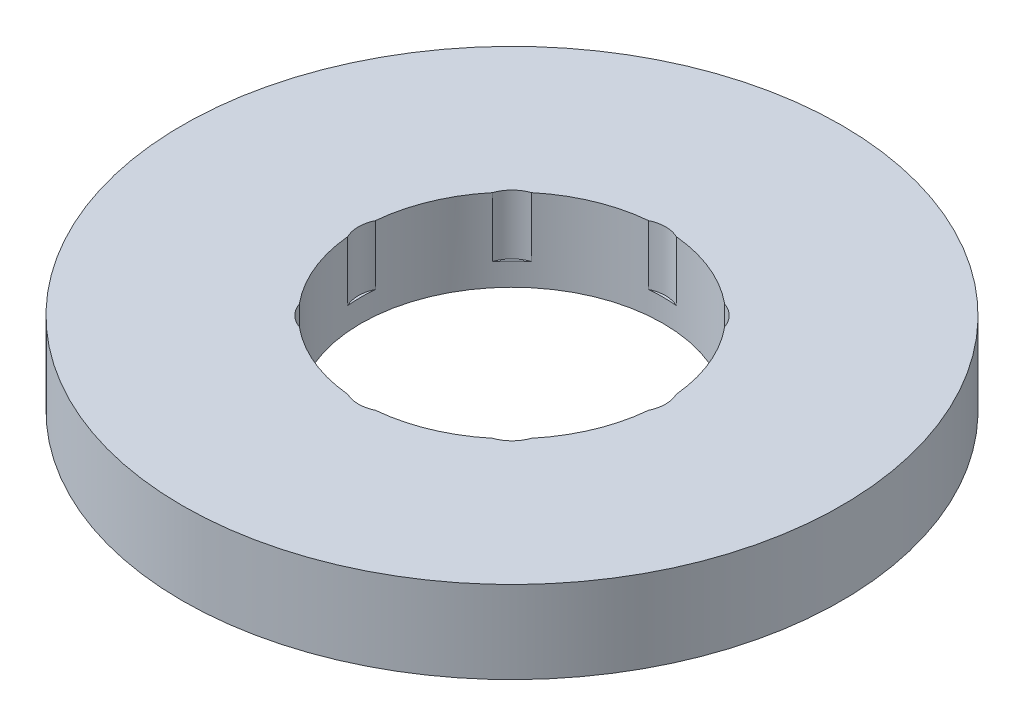
ISO-10303-21;
HEADER;
FILE_DESCRIPTION(('STEP AP214'),'2;1');
FILE_NAME('part.step','',(''),(''),'','','');
FILE_SCHEMA(('AUTOMOTIVE_DESIGN { 1 0 10303 214 1 1 1 1 }'));
ENDSEC;
DATA;
#1=APPLICATION_CONTEXT('core data for automotive mechanical design processes');
#2=APPLICATION_PROTOCOL_DEFINITION('international standard','automotive_design',2000,#1);
#3=PRODUCT_CONTEXT('',#1,'mechanical');
#4=PRODUCT('Part','Part','',(#3));
#5=PRODUCT_RELATED_PRODUCT_CATEGORY('part','',(#4));
#6=PRODUCT_DEFINITION_FORMATION('','',#4);
#7=PRODUCT_DEFINITION_CONTEXT('part definition',#1,'design');
#8=PRODUCT_DEFINITION('design','',#6,#7);
#9=PRODUCT_DEFINITION_SHAPE('','',#8);
#10=(LENGTH_UNIT() NAMED_UNIT(*) SI_UNIT(.MILLI.,.METRE.));
#11=(NAMED_UNIT(*) PLANE_ANGLE_UNIT() SI_UNIT($,.RADIAN.));
#12=(NAMED_UNIT(*) SI_UNIT($,.STERADIAN.) SOLID_ANGLE_UNIT());
#13=UNCERTAINTY_MEASURE_WITH_UNIT(LENGTH_MEASURE(1.E-05),#10,'distance_accuracy_value','');
#14=(GEOMETRIC_REPRESENTATION_CONTEXT(3) GLOBAL_UNCERTAINTY_ASSIGNED_CONTEXT((#13)) GLOBAL_UNIT_ASSIGNED_CONTEXT((#10,
#11,#12)) REPRESENTATION_CONTEXT('',''));
#15=CARTESIAN_POINT('',(0.,0.,0.));
#16=DIRECTION('',(0.,0.,1.));
#17=DIRECTION('',(1.,0.,0.));
#18=AXIS2_PLACEMENT_3D('',#15,#16,#17);
#19=CARTESIAN_POINT('',(0.,15.,0.));
#20=DIRECTION('',(0.,-1.,0.));
#21=DIRECTION('',(0.,0.,-1.));
#22=AXIS2_PLACEMENT_3D('',#19,#20,#21);
#23=CYLINDRICAL_SURFACE('',#22,60.);
#24=CARTESIAN_POINT('',(0.,15.,0.));
#25=DIRECTION('',(0.,1.,0.));
#26=DIRECTION('',(0.,0.,1.));
#27=AXIS2_PLACEMENT_3D('',#24,#25,#26);
#28=CIRCLE('',#27,60.);
#29=CARTESIAN_POINT('',(0.,15.,60.));
#30=VERTEX_POINT('',#29);
#31=EDGE_CURVE('E183',#30,#30,#28,.T.);
#32=ORIENTED_EDGE('',*,*,#31,.F.);
#33=EDGE_LOOP('',(#32));
#34=FACE_BOUND('',#33,.T.);
#35=CARTESIAN_POINT('',(0.,0.,0.));
#36=DIRECTION('',(0.,1.,0.));
#37=DIRECTION('',(0.,0.,1.));
#38=AXIS2_PLACEMENT_3D('',#35,#36,#37);
#39=CIRCLE('',#38,60.);
#40=CARTESIAN_POINT('',(0.,0.,60.));
#41=VERTEX_POINT('',#40);
#42=EDGE_CURVE('E182',#41,#41,#39,.T.);
#43=ORIENTED_EDGE('',*,*,#42,.T.);
#44=EDGE_LOOP('',(#43));
#45=FACE_BOUND('',#44,.T.);
#46=ADVANCED_FACE('F39',(#34,#45),#23,.T.);
#47=CARTESIAN_POINT('',(0.,15.,0.));
#48=DIRECTION('',(0.,1.,0.));
#49=DIRECTION('',(0.,0.,1.));
#50=AXIS2_PLACEMENT_3D('',#47,#48,#49);
#51=PLANE('',#50);
#52=CARTESIAN_POINT('',(0.,15.,22.1873358285686));
#53=DIRECTION('',(0.,1.,0.));
#54=DIRECTION('',(1.,0.,0.));
#55=AXIS2_PLACEMENT_3D('',#52,#53,#54);
#56=CIRCLE('',#55,5.77723652002444);
#57=CARTESIAN_POINT('',(-2.52432575617831,15.,27.3838963530885));
#58=VERTEX_POINT('',#57);
#59=CARTESIAN_POINT('',(2.5243257561785,15.,27.3838963530885));
#60=VERTEX_POINT('',#59);
#61=EDGE_CURVE('E256',#58,#60,#56,.T.);
#62=ORIENTED_EDGE('',*,*,#61,.F.);
#63=CARTESIAN_POINT('',(0.,15.,0.));
#64=DIRECTION('',(0.,1.,0.));
#65=DIRECTION('',(0.,0.,1.));
#66=AXIS2_PLACEMENT_3D('',#63,#64,#65);
#67=CIRCLE('',#66,27.5);
#68=CARTESIAN_POINT('',(-17.5783709464608,15.,21.1483066666961));
#69=VERTEX_POINT('',#68);
#70=EDGE_CURVE('E175',#69,#58,#67,.T.);
#71=ORIENTED_EDGE('',*,*,#70,.F.);
#72=CARTESIAN_POINT('',(-15.6888156208441,15.,15.6888156208441));
#73=DIRECTION('',(0.,1.,0.));
#74=DIRECTION('',(0.707106781186549,0.,0.707106781186546));
#75=AXIS2_PLACEMENT_3D('',#72,#73,#74);
#76=CIRCLE('',#75,5.77723652002444);
#77=CARTESIAN_POINT('',(-21.148306666696,15.,17.5783709464609));
#78=VERTEX_POINT('',#77);
#79=EDGE_CURVE('E152',#78,#69,#76,.T.);
#80=ORIENTED_EDGE('',*,*,#79,.F.);
#81=CARTESIAN_POINT('',(-27.3838963530885,15.,2.5243257561784));
#82=VERTEX_POINT('',#81);
#83=EDGE_CURVE('E168',#82,#78,#67,.T.);
#84=ORIENTED_EDGE('',*,*,#83,.F.);
#85=CARTESIAN_POINT('',(-22.1873358285686,15.,0.));
#86=DIRECTION('',(0.,1.,0.));
#87=DIRECTION('',(0.,0.,1.));
#88=AXIS2_PLACEMENT_3D('',#85,#86,#87);
#89=CIRCLE('',#88,5.77723652002444);
#90=CARTESIAN_POINT('',(-27.3838963530885,15.,-2.5243257561784));
#91=VERTEX_POINT('',#90);
#92=EDGE_CURVE('E205',#91,#82,#89,.T.);
#93=ORIENTED_EDGE('',*,*,#92,.F.);
#94=CARTESIAN_POINT('',(-21.1483066666963,15.,-17.5783709464606));
#95=VERTEX_POINT('',#94);
#96=EDGE_CURVE('E181',#95,#91,#67,.T.);
#97=ORIENTED_EDGE('',*,*,#96,.F.);
#98=CARTESIAN_POINT('',(-15.6888156208443,15.,-15.6888156208439));
#99=DIRECTION('',(0.,1.,0.));
#100=DIRECTION('',(-0.707106781186539,0.,0.707106781186556));
#101=AXIS2_PLACEMENT_3D('',#98,#99,#100);
#102=CIRCLE('',#101,5.77723652002444);
#103=CARTESIAN_POINT('',(-17.5783709464611,15.,-21.1483066666958));
#104=VERTEX_POINT('',#103);
#105=EDGE_CURVE('E453',#104,#95,#102,.T.);
#106=ORIENTED_EDGE('',*,*,#105,.F.);
#107=CARTESIAN_POINT('',(-2.52432575617869,15.,-27.3838963530885));
#108=VERTEX_POINT('',#107);
#109=EDGE_CURVE('E189',#108,#104,#67,.T.);
#110=ORIENTED_EDGE('',*,*,#109,.F.);
#111=CARTESIAN_POINT('',(-2.32400007012279E-13,15.,-22.1873358285686));
#112=DIRECTION('',(0.,1.,0.));
#113=DIRECTION('',(-1.,0.,0.));
#114=AXIS2_PLACEMENT_3D('',#111,#112,#113);
#115=CIRCLE('',#114,5.77723652002444);
#116=CARTESIAN_POINT('',(2.52432575617812,15.,-27.3838963530885));
#117=VERTEX_POINT('',#116);
#118=EDGE_CURVE('E462',#117,#108,#115,.T.);
#119=ORIENTED_EDGE('',*,*,#118,.F.);
#120=CARTESIAN_POINT('',(17.5783709464607,15.,-21.1483066666962));
#121=VERTEX_POINT('',#120);
#122=EDGE_CURVE('E197',#121,#117,#67,.T.);
#123=ORIENTED_EDGE('',*,*,#122,.F.);
#124=CARTESIAN_POINT('',(15.688815620844,15.,-15.6888156208443));
#125=DIRECTION('',(0.,1.,0.));
#126=DIRECTION('',(-0.707106781186554,0.,-0.707106781186541));
#127=AXIS2_PLACEMENT_3D('',#124,#125,#126);
#128=CIRCLE('',#127,5.77723652002444);
#129=CARTESIAN_POINT('',(21.1483066666959,15.,-17.578370946461));
#130=VERTEX_POINT('',#129);
#131=EDGE_CURVE('E470',#130,#121,#128,.T.);
#132=ORIENTED_EDGE('',*,*,#131,.F.);
#133=CARTESIAN_POINT('',(27.3838963530885,15.,-2.5243257561784));
#134=VERTEX_POINT('',#133);
#135=EDGE_CURVE('E489',#134,#130,#67,.T.);
#136=ORIENTED_EDGE('',*,*,#135,.F.);
#137=CARTESIAN_POINT('',(22.1873358285686,15.,0.));
#138=DIRECTION('',(0.,1.,0.));
#139=DIRECTION('',(0.,0.,-1.));
#140=AXIS2_PLACEMENT_3D('',#137,#138,#139);
#141=CIRCLE('',#140,5.77723652002444);
#142=CARTESIAN_POINT('',(27.3838963530885,15.,2.5243257561784));
#143=VERTEX_POINT('',#142);
#144=EDGE_CURVE('E476',#143,#134,#141,.T.);
#145=ORIENTED_EDGE('',*,*,#144,.F.);
#146=CARTESIAN_POINT('',(21.1483066666962,15.,17.5783709464607));
#147=VERTEX_POINT('',#146);
#148=EDGE_CURVE('E491',#147,#143,#67,.T.);
#149=ORIENTED_EDGE('',*,*,#148,.F.);
#150=CARTESIAN_POINT('',(15.6888156208442,15.,15.688815620844));
#151=DIRECTION('',(0.,1.,0.));
#152=DIRECTION('',(0.707106781186544,0.,-0.707106781186551));
#153=AXIS2_PLACEMENT_3D('',#150,#151,#152);
#154=CIRCLE('',#153,5.77723652002444);
#155=CARTESIAN_POINT('',(17.578370946461,15.,21.148306666696));
#156=VERTEX_POINT('',#155);
#157=EDGE_CURVE('E475',#156,#147,#154,.T.);
#158=ORIENTED_EDGE('',*,*,#157,.F.);
#159=EDGE_CURVE('E190',#60,#156,#67,.T.);
#160=ORIENTED_EDGE('',*,*,#159,.F.);
#161=EDGE_LOOP('',(#62,#71,#80,#84,#93,#97,#106,#110,#119,#123,#132,#136,#145,#149,#158,#160));
#162=FACE_BOUND('',#161,.T.);
#163=ORIENTED_EDGE('',*,*,#31,.T.);
#164=EDGE_LOOP('',(#163));
#165=FACE_BOUND('',#164,.T.);
#166=ADVANCED_FACE('F170',(#162,#165),#51,.T.);
#167=CARTESIAN_POINT('',(0.,0.,0.));
#168=DIRECTION('',(0.,1.,0.));
#169=DIRECTION('',(0.,0.,1.));
#170=AXIS2_PLACEMENT_3D('',#167,#168,#169);
#171=PLANE('',#170);
#172=CARTESIAN_POINT('',(0.,0.,0.));
#173=DIRECTION('',(0.,1.,0.));
#174=DIRECTION('',(0.,0.,1.));
#175=AXIS2_PLACEMENT_3D('',#172,#173,#174);
#176=CIRCLE('',#175,27.5);
#177=CARTESIAN_POINT('',(0.,0.,27.5));
#178=VERTEX_POINT('',#177);
#179=EDGE_CURVE('E191',#178,#178,#176,.T.);
#180=ORIENTED_EDGE('',*,*,#179,.T.);
#181=EDGE_LOOP('',(#180));
#182=FACE_BOUND('',#181,.T.);
#183=ORIENTED_EDGE('',*,*,#42,.F.);
#184=EDGE_LOOP('',(#183));
#185=FACE_BOUND('',#184,.T.);
#186=ADVANCED_FACE('F277',(#182,#185),#171,.F.);
#187=CARTESIAN_POINT('',(0.,15.,0.));
#188=DIRECTION('',(0.,-1.,0.));
#189=DIRECTION('',(0.,0.,-1.));
#190=AXIS2_PLACEMENT_3D('',#187,#188,#189);
#191=CYLINDRICAL_SURFACE('',#190,27.5);
#192=DIRECTION('',(0.,1.,0.));
#193=VECTOR('',#192,1.);
#194=CARTESIAN_POINT('',(-2.52432575617828,9.56838124463281,27.3838963530885));
#195=LINE('',#194,#193);
#196=CARTESIAN_POINT('',(-2.52432575617831,4.13676248926562,27.3838963530885));
#197=VERTEX_POINT('',#196);
#198=EDGE_CURVE('E11',#197,#58,#195,.T.);
#199=ORIENTED_EDGE('',*,*,#198,.F.);
#200=CARTESIAN_POINT('',(0.,4.13676248926562,0.));
#201=DIRECTION('',(0.,1.,0.));
#202=DIRECTION('',(0.,0.,1.));
#203=AXIS2_PLACEMENT_3D('',#200,#201,#202);
#204=CIRCLE('',#203,27.5);
#205=CARTESIAN_POINT('',(2.5243257561785,4.13676248926562,27.3838963530885));
#206=VERTEX_POINT('',#205);
#207=EDGE_CURVE('E251',#197,#206,#204,.T.);
#208=ORIENTED_EDGE('',*,*,#207,.T.);
#209=DIRECTION('',(0.,1.,0.));
#210=VECTOR('',#209,1.);
#211=CARTESIAN_POINT('',(2.52432575617847,9.56838124463281,27.3838963530885));
#212=LINE('',#211,#210);
#213=EDGE_CURVE('E46',#60,#206,#212,.F.);
#214=ORIENTED_EDGE('',*,*,#213,.F.);
#215=ORIENTED_EDGE('',*,*,#159,.T.);
#216=DIRECTION('',(0.,1.,0.));
#217=VECTOR('',#216,1.);
#218=CARTESIAN_POINT('',(17.578370946461,9.56838124463281,21.148306666696));
#219=LINE('',#218,#217);
#220=CARTESIAN_POINT('',(17.578370946461,4.13676248926562,21.148306666696));
#221=VERTEX_POINT('',#220);
#222=EDGE_CURVE('E253',#221,#156,#219,.T.);
#223=ORIENTED_EDGE('',*,*,#222,.F.);
#224=CARTESIAN_POINT('',(0.,4.13676248926562,0.));
#225=DIRECTION('',(0.,1.,0.));
#226=DIRECTION('',(0.,0.,1.));
#227=AXIS2_PLACEMENT_3D('',#224,#225,#226);
#228=CIRCLE('',#227,27.5);
#229=CARTESIAN_POINT('',(21.1483066666962,4.13676248926562,17.5783709464607));
#230=VERTEX_POINT('',#229);
#231=EDGE_CURVE('E246',#221,#230,#228,.T.);
#232=ORIENTED_EDGE('',*,*,#231,.T.);
#233=DIRECTION('',(0.,1.,0.));
#234=VECTOR('',#233,1.);
#235=CARTESIAN_POINT('',(21.1483066666961,9.56838124463281,17.5783709464608));
#236=LINE('',#235,#234);
#237=EDGE_CURVE('E248',#147,#230,#236,.F.);
#238=ORIENTED_EDGE('',*,*,#237,.F.);
#239=ORIENTED_EDGE('',*,*,#148,.T.);
#240=DIRECTION('',(0.,1.,0.));
#241=VECTOR('',#240,1.);
#242=CARTESIAN_POINT('',(27.3838963530885,9.56838124463281,2.52432575617837));
#243=LINE('',#242,#241);
#244=CARTESIAN_POINT('',(27.3838963530885,4.13676248926562,2.5243257561784));
#245=VERTEX_POINT('',#244);
#246=EDGE_CURVE('E243',#245,#143,#243,.T.);
#247=ORIENTED_EDGE('',*,*,#246,.F.);
#248=CARTESIAN_POINT('',(0.,4.13676248926562,0.));
#249=DIRECTION('',(0.,1.,0.));
#250=DIRECTION('',(0.,0.,1.));
#251=AXIS2_PLACEMENT_3D('',#248,#249,#250);
#252=CIRCLE('',#251,27.5);
#253=CARTESIAN_POINT('',(27.3838963530885,4.13676248926562,-2.5243257561784));
#254=VERTEX_POINT('',#253);
#255=EDGE_CURVE('E236',#245,#254,#252,.T.);
#256=ORIENTED_EDGE('',*,*,#255,.T.);
#257=DIRECTION('',(0.,1.,0.));
#258=VECTOR('',#257,1.);
#259=CARTESIAN_POINT('',(27.3838963530885,9.56838124463281,-2.52432575617837));
#260=LINE('',#259,#258);
#261=EDGE_CURVE('E241',#134,#254,#260,.F.);
#262=ORIENTED_EDGE('',*,*,#261,.F.);
#263=ORIENTED_EDGE('',*,*,#135,.T.);
#264=DIRECTION('',(0.,1.,0.));
#265=VECTOR('',#264,1.);
#266=CARTESIAN_POINT('',(21.1483066666959,9.56838124463281,-17.5783709464611));
#267=LINE('',#266,#265);
#268=CARTESIAN_POINT('',(21.1483066666959,4.13676248926562,-17.578370946461));
#269=VERTEX_POINT('',#268);
#270=EDGE_CURVE('E237',#269,#130,#267,.T.);
#271=ORIENTED_EDGE('',*,*,#270,.F.);
#272=CARTESIAN_POINT('',(0.,4.13676248926562,0.));
#273=DIRECTION('',(0.,1.,0.));
#274=DIRECTION('',(0.,0.,1.));
#275=AXIS2_PLACEMENT_3D('',#272,#273,#274);
#276=CIRCLE('',#275,27.5);
#277=CARTESIAN_POINT('',(17.5783709464607,4.13676248926562,-21.1483066666962));
#278=VERTEX_POINT('',#277);
#279=EDGE_CURVE('E229',#269,#278,#276,.T.);
#280=ORIENTED_EDGE('',*,*,#279,.T.);
#281=DIRECTION('',(0.,1.,0.));
#282=VECTOR('',#281,1.);
#283=CARTESIAN_POINT('',(17.5783709464607,9.56838124463281,-21.1483066666962));
#284=LINE('',#283,#282);
#285=EDGE_CURVE('E232',#121,#278,#284,.F.);
#286=ORIENTED_EDGE('',*,*,#285,.F.);
#287=ORIENTED_EDGE('',*,*,#122,.T.);
#288=DIRECTION('',(0.,1.,0.));
#289=VECTOR('',#288,1.);
#290=CARTESIAN_POINT('',(2.52432575617809,9.56838124463281,-27.3838963530886));
#291=LINE('',#290,#289);
#292=CARTESIAN_POINT('',(2.52432575617812,4.13676248926562,-27.3838963530885));
#293=VERTEX_POINT('',#292);
#294=EDGE_CURVE('E227',#293,#117,#291,.T.);
#295=ORIENTED_EDGE('',*,*,#294,.F.);
#296=CARTESIAN_POINT('',(0.,4.13676248926562,0.));
#297=DIRECTION('',(0.,1.,0.));
#298=DIRECTION('',(0.,0.,1.));
#299=AXIS2_PLACEMENT_3D('',#296,#297,#298);
#300=CIRCLE('',#299,27.5);
#301=CARTESIAN_POINT('',(-2.52432575617869,4.13676248926562,-27.3838963530885));
#302=VERTEX_POINT('',#301);
#303=EDGE_CURVE('E225',#293,#302,#300,.T.);
#304=ORIENTED_EDGE('',*,*,#303,.T.);
#305=DIRECTION('',(0.,1.,0.));
#306=VECTOR('',#305,1.);
#307=CARTESIAN_POINT('',(-2.52432575617866,9.56838124463281,-27.3838963530885));
#308=LINE('',#307,#306);
#309=EDGE_CURVE('E223',#108,#302,#308,.F.);
#310=ORIENTED_EDGE('',*,*,#309,.F.);
#311=ORIENTED_EDGE('',*,*,#109,.T.);
#312=DIRECTION('',(0.,1.,0.));
#313=VECTOR('',#312,1.);
#314=CARTESIAN_POINT('',(-17.5783709464611,9.56838124463281,-21.1483066666958));
#315=LINE('',#314,#313);
#316=CARTESIAN_POINT('',(-17.5783709464611,4.13676248926562,-21.1483066666958));
#317=VERTEX_POINT('',#316);
#318=EDGE_CURVE('E219',#317,#104,#315,.T.);
#319=ORIENTED_EDGE('',*,*,#318,.F.);
#320=CARTESIAN_POINT('',(0.,4.13676248926562,0.));
#321=DIRECTION('',(0.,1.,0.));
#322=DIRECTION('',(0.,0.,1.));
#323=AXIS2_PLACEMENT_3D('',#320,#321,#322);
#324=CIRCLE('',#323,27.5);
#325=CARTESIAN_POINT('',(-21.1483066666963,4.13676248926562,-17.5783709464606));
#326=VERTEX_POINT('',#325);
#327=EDGE_CURVE('E159',#317,#326,#324,.T.);
#328=ORIENTED_EDGE('',*,*,#327,.T.);
#329=DIRECTION('',(0.,1.,0.));
#330=VECTOR('',#329,1.);
#331=CARTESIAN_POINT('',(-21.1483066666963,9.56838124463281,-17.5783709464606));
#332=LINE('',#331,#330);
#333=EDGE_CURVE('E220',#95,#326,#332,.F.);
#334=ORIENTED_EDGE('',*,*,#333,.F.);
#335=ORIENTED_EDGE('',*,*,#96,.T.);
#336=DIRECTION('',(0.,1.,0.));
#337=VECTOR('',#336,1.);
#338=CARTESIAN_POINT('',(-27.3838963530885,9.56838124463281,-2.52432575617837));
#339=LINE('',#338,#337);
#340=CARTESIAN_POINT('',(-27.3838963530885,4.13676248926562,-2.5243257561784));
#341=VERTEX_POINT('',#340);
#342=EDGE_CURVE('E209',#341,#91,#339,.T.);
#343=ORIENTED_EDGE('',*,*,#342,.F.);
#344=CARTESIAN_POINT('',(0.,4.13676248926562,0.));
#345=DIRECTION('',(0.,1.,0.));
#346=DIRECTION('',(0.,0.,1.));
#347=AXIS2_PLACEMENT_3D('',#344,#345,#346);
#348=CIRCLE('',#347,27.5);
#349=CARTESIAN_POINT('',(-27.3838963530885,4.13676248926562,2.5243257561784));
#350=VERTEX_POINT('',#349);
#351=EDGE_CURVE('E206',#341,#350,#348,.T.);
#352=ORIENTED_EDGE('',*,*,#351,.T.);
#353=DIRECTION('',(0.,1.,0.));
#354=VECTOR('',#353,1.);
#355=CARTESIAN_POINT('',(-27.3838963530885,9.56838124463281,2.52432575617837));
#356=LINE('',#355,#354);
#357=EDGE_CURVE('E179',#82,#350,#356,.F.);
#358=ORIENTED_EDGE('',*,*,#357,.F.);
#359=ORIENTED_EDGE('',*,*,#83,.T.);
#360=DIRECTION('',(0.,1.,0.));
#361=VECTOR('',#360,1.);
#362=CARTESIAN_POINT('',(-21.148306666696,9.56838124463281,17.5783709464609));
#363=LINE('',#362,#361);
#364=CARTESIAN_POINT('',(-21.148306666696,4.13676248926562,17.5783709464609));
#365=VERTEX_POINT('',#364);
#366=EDGE_CURVE('E147',#365,#78,#363,.T.);
#367=ORIENTED_EDGE('',*,*,#366,.F.);
#368=CARTESIAN_POINT('',(0.,4.13676248926562,0.));
#369=DIRECTION('',(0.,1.,0.));
#370=DIRECTION('',(0.,0.,1.));
#371=AXIS2_PLACEMENT_3D('',#368,#369,#370);
#372=CIRCLE('',#371,27.5);
#373=CARTESIAN_POINT('',(-17.5783709464608,4.13676248926562,21.1483066666961));
#374=VERTEX_POINT('',#373);
#375=EDGE_CURVE('E215',#365,#374,#372,.T.);
#376=ORIENTED_EDGE('',*,*,#375,.T.);
#377=DIRECTION('',(0.,1.,0.));
#378=VECTOR('',#377,1.);
#379=CARTESIAN_POINT('',(-17.5783709464608,9.56838124463281,21.1483066666961));
#380=LINE('',#379,#378);
#381=EDGE_CURVE('E161',#69,#374,#380,.F.);
#382=ORIENTED_EDGE('',*,*,#381,.F.);
#383=ORIENTED_EDGE('',*,*,#70,.T.);
#384=EDGE_LOOP('',(#199,#208,#214,#215,#223,#232,#238,#239,#247,#256,#262,#263,#271,#280,#286,
#287,#295,#304,#310,#311,#319,#328,#334,#335,#343,#352,#358,#359,#367,#376,#382,#383));
#385=FACE_BOUND('',#384,.T.);
#386=ORIENTED_EDGE('',*,*,#179,.F.);
#387=EDGE_LOOP('',(#386));
#388=FACE_BOUND('',#387,.T.);
#389=ADVANCED_FACE('F176',(#385,#388),#191,.F.);
#390=CARTESIAN_POINT('',(-22.1873358285686,4.13676248926562,0.));
#391=DIRECTION('',(0.,1.,0.));
#392=DIRECTION('',(0.,0.,1.));
#393=AXIS2_PLACEMENT_3D('',#390,#391,#392);
#394=CYLINDRICAL_SURFACE('',#393,5.77723652002444);
#395=ORIENTED_EDGE('',*,*,#342,.T.);
#396=ORIENTED_EDGE('',*,*,#92,.T.);
#397=ORIENTED_EDGE('',*,*,#357,.T.);
#398=CARTESIAN_POINT('',(-22.1873358285686,4.13676248926562,0.));
#399=DIRECTION('',(0.,1.,0.));
#400=DIRECTION('',(0.,0.,1.));
#401=AXIS2_PLACEMENT_3D('',#398,#399,#400);
#402=CIRCLE('',#401,5.77723652002444);
#403=EDGE_CURVE('E200',#341,#350,#402,.T.);
#404=ORIENTED_EDGE('',*,*,#403,.F.);
#405=EDGE_LOOP('',(#395,#396,#397,#404));
#406=FACE_BOUND('',#405,.T.);
#407=ADVANCED_FACE('F286',(#406),#394,.F.);
#408=CARTESIAN_POINT('',(-22.1873358285686,4.13676248926562,0.));
#409=DIRECTION('',(0.,1.,0.));
#410=DIRECTION('',(0.,0.,1.));
#411=AXIS2_PLACEMENT_3D('',#408,#409,#410);
#412=PLANE('',#411);
#413=ORIENTED_EDGE('',*,*,#403,.T.);
#414=ORIENTED_EDGE('',*,*,#351,.F.);
#415=EDGE_LOOP('',(#413,#414));
#416=FACE_BOUND('',#415,.T.);
#417=ADVANCED_FACE('F289',(#416),#412,.T.);
#418=CARTESIAN_POINT('',(-15.6888156208441,4.13676248926562,15.6888156208441));
#419=DIRECTION('',(0.,1.,0.));
#420=DIRECTION('',(0.,0.,1.));
#421=AXIS2_PLACEMENT_3D('',#418,#419,#420);
#422=CYLINDRICAL_SURFACE('',#421,5.77723652002444);
#423=ORIENTED_EDGE('',*,*,#366,.T.);
#424=ORIENTED_EDGE('',*,*,#79,.T.);
#425=ORIENTED_EDGE('',*,*,#381,.T.);
#426=CARTESIAN_POINT('',(-15.6888156208441,4.13676248926562,15.6888156208441));
#427=DIRECTION('',(0.,1.,0.));
#428=DIRECTION('',(0.707106781186549,0.,0.707106781186546));
#429=AXIS2_PLACEMENT_3D('',#426,#427,#428);
#430=CIRCLE('',#429,5.77723652002444);
#431=EDGE_CURVE('E156',#365,#374,#430,.T.);
#432=ORIENTED_EDGE('',*,*,#431,.F.);
#433=EDGE_LOOP('',(#423,#424,#425,#432));
#434=FACE_BOUND('',#433,.T.);
#435=ADVANCED_FACE('F155',(#434),#422,.F.);
#436=CARTESIAN_POINT('',(-15.6888156208441,4.13676248926562,15.6888156208441));
#437=DIRECTION('',(0.,1.,0.));
#438=DIRECTION('',(0.707106781186549,0.,0.707106781186546));
#439=AXIS2_PLACEMENT_3D('',#436,#437,#438);
#440=PLANE('',#439);
#441=ORIENTED_EDGE('',*,*,#431,.T.);
#442=ORIENTED_EDGE('',*,*,#375,.F.);
#443=EDGE_LOOP('',(#441,#442));
#444=FACE_BOUND('',#443,.T.);
#445=ADVANCED_FACE('F300',(#444),#440,.T.);
#446=CARTESIAN_POINT('',(-15.6888156208443,4.13676248926562,-15.6888156208439));
#447=DIRECTION('',(0.,1.,0.));
#448=DIRECTION('',(0.,0.,1.));
#449=AXIS2_PLACEMENT_3D('',#446,#447,#448);
#450=CYLINDRICAL_SURFACE('',#449,5.77723652002444);
#451=ORIENTED_EDGE('',*,*,#318,.T.);
#452=ORIENTED_EDGE('',*,*,#105,.T.);
#453=ORIENTED_EDGE('',*,*,#333,.T.);
#454=CARTESIAN_POINT('',(-15.6888156208443,4.13676248926562,-15.6888156208439));
#455=DIRECTION('',(0.,1.,0.));
#456=DIRECTION('',(-0.707106781186539,0.,0.707106781186556));
#457=AXIS2_PLACEMENT_3D('',#454,#455,#456);
#458=CIRCLE('',#457,5.77723652002444);
#459=EDGE_CURVE('E454',#317,#326,#458,.T.);
#460=ORIENTED_EDGE('',*,*,#459,.F.);
#461=EDGE_LOOP('',(#451,#452,#453,#460));
#462=FACE_BOUND('',#461,.T.);
#463=ADVANCED_FACE('F299',(#462),#450,.F.);
#464=CARTESIAN_POINT('',(-15.6888156208443,4.13676248926562,-15.6888156208439));
#465=DIRECTION('',(0.,1.,0.));
#466=DIRECTION('',(-0.707106781186539,0.,0.707106781186556));
#467=AXIS2_PLACEMENT_3D('',#464,#465,#466);
#468=PLANE('',#467);
#469=ORIENTED_EDGE('',*,*,#459,.T.);
#470=ORIENTED_EDGE('',*,*,#327,.F.);
#471=EDGE_LOOP('',(#469,#470));
#472=FACE_BOUND('',#471,.T.);
#473=ADVANCED_FACE('F379',(#472),#468,.T.);
#474=CARTESIAN_POINT('',(-2.32400007012279E-13,4.13676248926562,-22.1873358285686));
#475=DIRECTION('',(0.,1.,0.));
#476=DIRECTION('',(0.,0.,1.));
#477=AXIS2_PLACEMENT_3D('',#474,#475,#476);
#478=CYLINDRICAL_SURFACE('',#477,5.77723652002444);
#479=ORIENTED_EDGE('',*,*,#294,.T.);
#480=ORIENTED_EDGE('',*,*,#118,.T.);
#481=ORIENTED_EDGE('',*,*,#309,.T.);
#482=CARTESIAN_POINT('',(-2.32400007012279E-13,4.13676248926562,-22.1873358285686));
#483=DIRECTION('',(0.,1.,0.));
#484=DIRECTION('',(-1.,0.,0.));
#485=AXIS2_PLACEMENT_3D('',#482,#483,#484);
#486=CIRCLE('',#485,5.77723652002444);
#487=EDGE_CURVE('E465',#293,#302,#486,.T.);
#488=ORIENTED_EDGE('',*,*,#487,.F.);
#489=EDGE_LOOP('',(#479,#480,#481,#488));
#490=FACE_BOUND('',#489,.T.);
#491=ADVANCED_FACE('F371',(#490),#478,.F.);
#492=CARTESIAN_POINT('',(-2.32400007012279E-13,4.13676248926562,-22.1873358285686));
#493=DIRECTION('',(0.,1.,0.));
#494=DIRECTION('',(-1.,0.,0.));
#495=AXIS2_PLACEMENT_3D('',#492,#493,#494);
#496=PLANE('',#495);
#497=ORIENTED_EDGE('',*,*,#487,.T.);
#498=ORIENTED_EDGE('',*,*,#303,.F.);
#499=EDGE_LOOP('',(#497,#498));
#500=FACE_BOUND('',#499,.T.);
#501=ADVANCED_FACE('F308',(#500),#496,.T.);
#502=CARTESIAN_POINT('',(15.688815620844,4.13676248926562,-15.6888156208443));
#503=DIRECTION('',(0.,1.,0.));
#504=DIRECTION('',(0.,0.,1.));
#505=AXIS2_PLACEMENT_3D('',#502,#503,#504);
#506=CYLINDRICAL_SURFACE('',#505,5.77723652002444);
#507=ORIENTED_EDGE('',*,*,#270,.T.);
#508=ORIENTED_EDGE('',*,*,#131,.T.);
#509=ORIENTED_EDGE('',*,*,#285,.T.);
#510=CARTESIAN_POINT('',(15.688815620844,4.13676248926562,-15.6888156208443));
#511=DIRECTION('',(0.,1.,0.));
#512=DIRECTION('',(-0.707106781186554,0.,-0.707106781186541));
#513=AXIS2_PLACEMENT_3D('',#510,#511,#512);
#514=CIRCLE('',#513,5.77723652002444);
#515=EDGE_CURVE('E477',#269,#278,#514,.T.);
#516=ORIENTED_EDGE('',*,*,#515,.F.);
#517=EDGE_LOOP('',(#507,#508,#509,#516));
#518=FACE_BOUND('',#517,.T.);
#519=ADVANCED_FACE('F305',(#518),#506,.F.);
#520=CARTESIAN_POINT('',(15.688815620844,4.13676248926562,-15.6888156208443));
#521=DIRECTION('',(0.,1.,0.));
#522=DIRECTION('',(-0.707106781186554,0.,-0.707106781186541));
#523=AXIS2_PLACEMENT_3D('',#520,#521,#522);
#524=PLANE('',#523);
#525=ORIENTED_EDGE('',*,*,#515,.T.);
#526=ORIENTED_EDGE('',*,*,#279,.F.);
#527=EDGE_LOOP('',(#525,#526));
#528=FACE_BOUND('',#527,.T.);
#529=ADVANCED_FACE('F304',(#528),#524,.T.);
#530=CARTESIAN_POINT('',(22.1873358285686,4.13676248926562,0.));
#531=DIRECTION('',(0.,1.,0.));
#532=DIRECTION('',(0.,0.,1.));
#533=AXIS2_PLACEMENT_3D('',#530,#531,#532);
#534=CYLINDRICAL_SURFACE('',#533,5.77723652002444);
#535=ORIENTED_EDGE('',*,*,#246,.T.);
#536=ORIENTED_EDGE('',*,*,#144,.T.);
#537=ORIENTED_EDGE('',*,*,#261,.T.);
#538=CARTESIAN_POINT('',(22.1873358285686,4.13676248926562,0.));
#539=DIRECTION('',(0.,1.,0.));
#540=DIRECTION('',(0.,0.,-1.));
#541=AXIS2_PLACEMENT_3D('',#538,#539,#540);
#542=CIRCLE('',#541,5.77723652002444);
#543=EDGE_CURVE('E478',#245,#254,#542,.T.);
#544=ORIENTED_EDGE('',*,*,#543,.F.);
#545=EDGE_LOOP('',(#535,#536,#537,#544));
#546=FACE_BOUND('',#545,.T.);
#547=ADVANCED_FACE('F309',(#546),#534,.F.);
#548=CARTESIAN_POINT('',(22.1873358285686,4.13676248926562,0.));
#549=DIRECTION('',(0.,1.,0.));
#550=DIRECTION('',(0.,0.,-1.));
#551=AXIS2_PLACEMENT_3D('',#548,#549,#550);
#552=PLANE('',#551);
#553=ORIENTED_EDGE('',*,*,#543,.T.);
#554=ORIENTED_EDGE('',*,*,#255,.F.);
#555=EDGE_LOOP('',(#553,#554));
#556=FACE_BOUND('',#555,.T.);
#557=ADVANCED_FACE('F314',(#556),#552,.T.);
#558=CARTESIAN_POINT('',(15.6888156208442,4.13676248926562,15.688815620844));
#559=DIRECTION('',(0.,1.,0.));
#560=DIRECTION('',(0.,0.,1.));
#561=AXIS2_PLACEMENT_3D('',#558,#559,#560);
#562=CYLINDRICAL_SURFACE('',#561,5.77723652002444);
#563=ORIENTED_EDGE('',*,*,#222,.T.);
#564=ORIENTED_EDGE('',*,*,#157,.T.);
#565=ORIENTED_EDGE('',*,*,#237,.T.);
#566=CARTESIAN_POINT('',(15.6888156208442,4.13676248926562,15.688815620844));
#567=DIRECTION('',(0.,1.,0.));
#568=DIRECTION('',(0.707106781186544,0.,-0.707106781186551));
#569=AXIS2_PLACEMENT_3D('',#566,#567,#568);
#570=CIRCLE('',#569,5.77723652002444);
#571=EDGE_CURVE('E56',#221,#230,#570,.T.);
#572=ORIENTED_EDGE('',*,*,#571,.F.);
#573=EDGE_LOOP('',(#563,#564,#565,#572));
#574=FACE_BOUND('',#573,.T.);
#575=ADVANCED_FACE('F318',(#574),#562,.F.);
#576=CARTESIAN_POINT('',(15.6888156208442,4.13676248926562,15.688815620844));
#577=DIRECTION('',(0.,1.,0.));
#578=DIRECTION('',(0.707106781186544,0.,-0.707106781186551));
#579=AXIS2_PLACEMENT_3D('',#576,#577,#578);
#580=PLANE('',#579);
#581=ORIENTED_EDGE('',*,*,#571,.T.);
#582=ORIENTED_EDGE('',*,*,#231,.F.);
#583=EDGE_LOOP('',(#581,#582));
#584=FACE_BOUND('',#583,.T.);
#585=ADVANCED_FACE('F270',(#584),#580,.T.);
#586=CARTESIAN_POINT('',(0.,4.13676248926562,22.1873358285686));
#587=DIRECTION('',(0.,1.,0.));
#588=DIRECTION('',(0.,0.,1.));
#589=AXIS2_PLACEMENT_3D('',#586,#587,#588);
#590=CYLINDRICAL_SURFACE('',#589,5.77723652002444);
#591=ORIENTED_EDGE('',*,*,#198,.T.);
#592=ORIENTED_EDGE('',*,*,#61,.T.);
#593=ORIENTED_EDGE('',*,*,#213,.T.);
#594=CARTESIAN_POINT('',(0.,4.13676248926562,22.1873358285686));
#595=DIRECTION('',(0.,1.,0.));
#596=DIRECTION('',(1.,0.,0.));
#597=AXIS2_PLACEMENT_3D('',#594,#595,#596);
#598=CIRCLE('',#597,5.77723652002444);
#599=EDGE_CURVE('E55',#197,#206,#598,.T.);
#600=ORIENTED_EDGE('',*,*,#599,.F.);
#601=EDGE_LOOP('',(#591,#592,#593,#600));
#602=FACE_BOUND('',#601,.T.);
#603=ADVANCED_FACE('F260',(#602),#590,.F.);
#604=CARTESIAN_POINT('',(0.,4.13676248926562,22.1873358285686));
#605=DIRECTION('',(0.,1.,0.));
#606=DIRECTION('',(1.,0.,0.));
#607=AXIS2_PLACEMENT_3D('',#604,#605,#606);
#608=PLANE('',#607);
#609=ORIENTED_EDGE('',*,*,#599,.T.);
#610=ORIENTED_EDGE('',*,*,#207,.F.);
#611=EDGE_LOOP('',(#609,#610));
#612=FACE_BOUND('',#611,.T.);
#613=ADVANCED_FACE('F261',(#612),#608,.T.);
#614=CLOSED_SHELL('',(#46,#166,#186,#389,#407,#417,#435,#445,#463,#473,#491,#501,#519,#529,#547,
#557,#575,#585,#603,#613));
#615=MANIFOLD_SOLID_BREP('B2',#614);
#616=ADVANCED_BREP_SHAPE_REPRESENTATION('',(#18,#615),#14);
#617=SHAPE_DEFINITION_REPRESENTATION(#9,#616);
ENDSEC;
END-ISO-10303-21;
